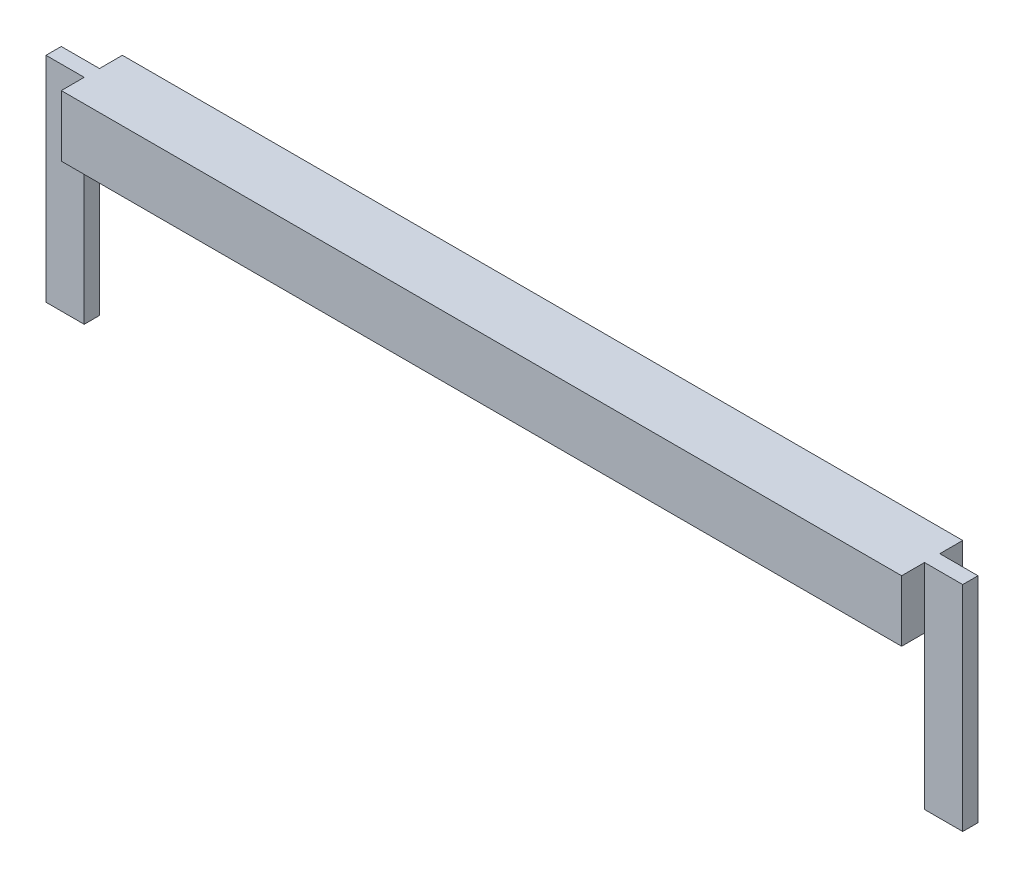
ISO-10303-21;
HEADER;
FILE_DESCRIPTION(('STEP AP214'),'2;1');
FILE_NAME('part.step','',(''),(''),'','','');
FILE_SCHEMA(('AUTOMOTIVE_DESIGN { 1 0 10303 214 1 1 1 1 }'));
ENDSEC;
DATA;
#1=APPLICATION_CONTEXT('core data for automotive mechanical design processes');
#2=APPLICATION_PROTOCOL_DEFINITION('international standard','automotive_design',2000,#1);
#3=PRODUCT_CONTEXT('',#1,'mechanical');
#4=PRODUCT('Part','Part','',(#3));
#5=PRODUCT_RELATED_PRODUCT_CATEGORY('part','',(#4));
#6=PRODUCT_DEFINITION_FORMATION('','',#4);
#7=PRODUCT_DEFINITION_CONTEXT('part definition',#1,'design');
#8=PRODUCT_DEFINITION('design','',#6,#7);
#9=PRODUCT_DEFINITION_SHAPE('','',#8);
#10=(LENGTH_UNIT() NAMED_UNIT(*) SI_UNIT(.MILLI.,.METRE.));
#11=(NAMED_UNIT(*) PLANE_ANGLE_UNIT() SI_UNIT($,.RADIAN.));
#12=(NAMED_UNIT(*) SI_UNIT($,.STERADIAN.) SOLID_ANGLE_UNIT());
#13=UNCERTAINTY_MEASURE_WITH_UNIT(LENGTH_MEASURE(1.E-05),#10,'distance_accuracy_value','');
#14=(GEOMETRIC_REPRESENTATION_CONTEXT(3) GLOBAL_UNCERTAINTY_ASSIGNED_CONTEXT((#13)) GLOBAL_UNIT_ASSIGNED_CONTEXT((#10,
#11,#12)) REPRESENTATION_CONTEXT('',''));
#15=CARTESIAN_POINT('',(0.,0.,0.));
#16=DIRECTION('',(0.,0.,1.));
#17=DIRECTION('',(1.,0.,0.));
#18=AXIS2_PLACEMENT_3D('',#15,#16,#17);
#19=CARTESIAN_POINT('',(0.,0.,0.5));
#20=DIRECTION('',(0.,1.,0.));
#21=DIRECTION('',(0.,0.,1.));
#22=AXIS2_PLACEMENT_3D('',#19,#20,#21);
#23=PLANE('',#22);
#24=DIRECTION('',(0.,0.,-1.));
#25=VECTOR('',#24,1.);
#26=CARTESIAN_POINT('',(28.75,0.,0.));
#27=LINE('',#26,#25);
#28=CARTESIAN_POINT('',(28.75,0.,0.5));
#29=VERTEX_POINT('',#28);
#30=CARTESIAN_POINT('',(28.75,0.,0.));
#31=VERTEX_POINT('',#30);
#32=EDGE_CURVE('E55',#29,#31,#27,.T.);
#33=ORIENTED_EDGE('',*,*,#32,.F.);
#34=DIRECTION('',(0.,0.,1.));
#35=VECTOR('',#34,1.);
#36=CARTESIAN_POINT('',(28.75,0.,-0.75));
#37=LINE('',#36,#35);
#38=CARTESIAN_POINT('',(28.75,0.,1.25));
#39=VERTEX_POINT('',#38);
#40=EDGE_CURVE('E242',#29,#39,#37,.T.);
#41=ORIENTED_EDGE('',*,*,#40,.T.);
#42=DIRECTION('',(1.,0.,0.));
#43=VECTOR('',#42,1.);
#44=CARTESIAN_POINT('',(28.75,0.,1.25));
#45=LINE('',#44,#43);
#46=CARTESIAN_POINT('',(1.25,0.,1.25));
#47=VERTEX_POINT('',#46);
#48=EDGE_CURVE('E210',#47,#39,#45,.T.);
#49=ORIENTED_EDGE('',*,*,#48,.F.);
#50=DIRECTION('',(0.,0.,1.));
#51=VECTOR('',#50,1.);
#52=CARTESIAN_POINT('',(1.25,0.,-0.75));
#53=LINE('',#52,#51);
#54=CARTESIAN_POINT('',(1.25,0.,0.5));
#55=VERTEX_POINT('',#54);
#56=EDGE_CURVE('E248',#55,#47,#53,.T.);
#57=ORIENTED_EDGE('',*,*,#56,.F.);
#58=DIRECTION('',(0.,0.,1.));
#59=VECTOR('',#58,1.);
#60=CARTESIAN_POINT('',(1.25,0.,0.));
#61=LINE('',#60,#59);
#62=CARTESIAN_POINT('',(1.25,0.,0.));
#63=VERTEX_POINT('',#62);
#64=EDGE_CURVE('E62',#63,#55,#61,.T.);
#65=ORIENTED_EDGE('',*,*,#64,.F.);
#66=CARTESIAN_POINT('',(1.25,0.,-0.75));
#67=VERTEX_POINT('',#66);
#68=EDGE_CURVE('E243',#67,#63,#53,.T.);
#69=ORIENTED_EDGE('',*,*,#68,.F.);
#70=DIRECTION('',(1.,0.,0.));
#71=VECTOR('',#70,1.);
#72=CARTESIAN_POINT('',(28.75,0.,-0.75));
#73=LINE('',#72,#71);
#74=CARTESIAN_POINT('',(28.75,0.,-0.75));
#75=VERTEX_POINT('',#74);
#76=EDGE_CURVE('E226',#67,#75,#73,.T.);
#77=ORIENTED_EDGE('',*,*,#76,.T.);
#78=EDGE_CURVE('E259',#75,#31,#37,.T.);
#79=ORIENTED_EDGE('',*,*,#78,.T.);
#80=EDGE_LOOP('',(#33,#41,#49,#57,#65,#69,#77,#79));
#81=FACE_BOUND('',#80,.T.);
#82=ADVANCED_FACE('F39',(#81),#23,.F.);
#83=CARTESIAN_POINT('',(0.,0.,0.5));
#84=DIRECTION('',(0.,0.,-1.));
#85=DIRECTION('',(-1.,0.,0.));
#86=AXIS2_PLACEMENT_3D('',#83,#84,#85);
#87=PLANE('',#86);
#88=DIRECTION('',(0.,1.,0.));
#89=VECTOR('',#88,1.);
#90=CARTESIAN_POINT('',(0.,0.,0.5));
#91=LINE('',#90,#89);
#92=CARTESIAN_POINT('',(0.,-5.,0.5));
#93=VERTEX_POINT('',#92);
#94=CARTESIAN_POINT('',(0.,2.,0.5));
#95=VERTEX_POINT('',#94);
#96=EDGE_CURVE('E269',#93,#95,#91,.T.);
#97=ORIENTED_EDGE('',*,*,#96,.F.);
#98=DIRECTION('',(-1.,0.,0.));
#99=VECTOR('',#98,1.);
#100=CARTESIAN_POINT('',(0.,-5.,0.5));
#101=LINE('',#100,#99);
#102=CARTESIAN_POINT('',(1.25,-5.,0.5));
#103=VERTEX_POINT('',#102);
#104=EDGE_CURVE('E196',#103,#93,#101,.T.);
#105=ORIENTED_EDGE('',*,*,#104,.F.);
#106=DIRECTION('',(0.,1.,0.));
#107=VECTOR('',#106,1.);
#108=CARTESIAN_POINT('',(1.25,-5.,0.5));
#109=LINE('',#108,#107);
#110=EDGE_CURVE('E200',#103,#55,#109,.T.);
#111=ORIENTED_EDGE('',*,*,#110,.T.);
#112=DIRECTION('',(0.,1.,0.));
#113=VECTOR('',#112,1.);
#114=CARTESIAN_POINT('',(1.25,0.,0.5));
#115=LINE('',#114,#113);
#116=CARTESIAN_POINT('',(1.25,2.,0.5));
#117=VERTEX_POINT('',#116);
#118=EDGE_CURVE('E264',#55,#117,#115,.T.);
#119=ORIENTED_EDGE('',*,*,#118,.T.);
#120=DIRECTION('',(1.,0.,0.));
#121=VECTOR('',#120,1.);
#122=CARTESIAN_POINT('',(0.,2.,0.5));
#123=LINE('',#122,#121);
#124=EDGE_CURVE('E154',#95,#117,#123,.T.);
#125=ORIENTED_EDGE('',*,*,#124,.F.);
#126=EDGE_LOOP('',(#97,#105,#111,#119,#125));
#127=FACE_BOUND('',#126,.T.);
#128=ADVANCED_FACE('F329',(#127),#87,.F.);
#129=CARTESIAN_POINT('',(0.,0.,0.));
#130=DIRECTION('',(0.,0.,-1.));
#131=DIRECTION('',(-1.,0.,0.));
#132=AXIS2_PLACEMENT_3D('',#129,#130,#131);
#133=PLANE('',#132);
#134=DIRECTION('',(0.,1.,0.));
#135=VECTOR('',#134,1.);
#136=CARTESIAN_POINT('',(1.25,0.,0.));
#137=LINE('',#136,#135);
#138=CARTESIAN_POINT('',(1.25,2.,0.));
#139=VERTEX_POINT('',#138);
#140=EDGE_CURVE('E11',#63,#139,#137,.T.);
#141=ORIENTED_EDGE('',*,*,#140,.F.);
#142=DIRECTION('',(0.,1.,0.));
#143=VECTOR('',#142,1.);
#144=CARTESIAN_POINT('',(1.25,-5.,0.));
#145=LINE('',#144,#143);
#146=CARTESIAN_POINT('',(1.25,-5.,0.));
#147=VERTEX_POINT('',#146);
#148=EDGE_CURVE('E206',#147,#63,#145,.T.);
#149=ORIENTED_EDGE('',*,*,#148,.F.);
#150=DIRECTION('',(1.,0.,0.));
#151=VECTOR('',#150,1.);
#152=CARTESIAN_POINT('',(0.,-5.,0.));
#153=LINE('',#152,#151);
#154=CARTESIAN_POINT('',(0.,-5.,0.));
#155=VERTEX_POINT('',#154);
#156=EDGE_CURVE('E190',#155,#147,#153,.T.);
#157=ORIENTED_EDGE('',*,*,#156,.F.);
#158=DIRECTION('',(0.,1.,0.));
#159=VECTOR('',#158,1.);
#160=CARTESIAN_POINT('',(0.,0.,0.));
#161=LINE('',#160,#159);
#162=CARTESIAN_POINT('',(0.,2.,0.));
#163=VERTEX_POINT('',#162);
#164=EDGE_CURVE('E268',#155,#163,#161,.T.);
#165=ORIENTED_EDGE('',*,*,#164,.T.);
#166=DIRECTION('',(1.,0.,0.));
#167=VECTOR('',#166,1.);
#168=CARTESIAN_POINT('',(0.,2.,0.));
#169=LINE('',#168,#167);
#170=EDGE_CURVE('E282',#163,#139,#169,.T.);
#171=ORIENTED_EDGE('',*,*,#170,.T.);
#172=EDGE_LOOP('',(#141,#149,#157,#165,#171));
#173=FACE_BOUND('',#172,.T.);
#174=ADVANCED_FACE('F337',(#173),#133,.T.);
#175=CARTESIAN_POINT('',(0.,0.,0.5));
#176=DIRECTION('',(-1.,0.,0.));
#177=DIRECTION('',(0.,0.,1.));
#178=AXIS2_PLACEMENT_3D('',#175,#176,#177);
#179=PLANE('',#178);
#180=ORIENTED_EDGE('',*,*,#164,.F.);
#181=DIRECTION('',(0.,0.,-1.));
#182=VECTOR('',#181,1.);
#183=CARTESIAN_POINT('',(0.,-5.,0.));
#184=LINE('',#183,#182);
#185=EDGE_CURVE('E186',#93,#155,#184,.T.);
#186=ORIENTED_EDGE('',*,*,#185,.F.);
#187=ORIENTED_EDGE('',*,*,#96,.T.);
#188=DIRECTION('',(0.,0.,-1.));
#189=VECTOR('',#188,1.);
#190=CARTESIAN_POINT('',(0.,2.,0.5));
#191=LINE('',#190,#189);
#192=EDGE_CURVE('E153',#95,#163,#191,.T.);
#193=ORIENTED_EDGE('',*,*,#192,.T.);
#194=EDGE_LOOP('',(#180,#186,#187,#193));
#195=FACE_BOUND('',#194,.T.);
#196=ADVANCED_FACE('F41',(#195),#179,.T.);
#197=CARTESIAN_POINT('',(30.,0.,0.5));
#198=DIRECTION('',(-1.,0.,0.));
#199=DIRECTION('',(0.,0.,1.));
#200=AXIS2_PLACEMENT_3D('',#197,#198,#199);
#201=PLANE('',#200);
#202=DIRECTION('',(0.,1.,0.));
#203=VECTOR('',#202,1.);
#204=CARTESIAN_POINT('',(30.,0.,0.));
#205=LINE('',#204,#203);
#206=CARTESIAN_POINT('',(30.,-5.,0.));
#207=VERTEX_POINT('',#206);
#208=CARTESIAN_POINT('',(30.,2.,0.));
#209=VERTEX_POINT('',#208);
#210=EDGE_CURVE('E274',#207,#209,#205,.T.);
#211=ORIENTED_EDGE('',*,*,#210,.T.);
#212=DIRECTION('',(0.,0.,-1.));
#213=VECTOR('',#212,1.);
#214=CARTESIAN_POINT('',(30.,2.,0.5));
#215=LINE('',#214,#213);
#216=CARTESIAN_POINT('',(30.,2.,0.5));
#217=VERTEX_POINT('',#216);
#218=EDGE_CURVE('E149',#217,#209,#215,.T.);
#219=ORIENTED_EDGE('',*,*,#218,.F.);
#220=DIRECTION('',(0.,1.,0.));
#221=VECTOR('',#220,1.);
#222=CARTESIAN_POINT('',(30.,0.,0.5));
#223=LINE('',#222,#221);
#224=CARTESIAN_POINT('',(30.,-5.,0.5));
#225=VERTEX_POINT('',#224);
#226=EDGE_CURVE('E142',#225,#217,#223,.T.);
#227=ORIENTED_EDGE('',*,*,#226,.F.);
#228=DIRECTION('',(0.,0.,1.));
#229=VECTOR('',#228,1.);
#230=CARTESIAN_POINT('',(30.,-5.,0.));
#231=LINE('',#230,#229);
#232=EDGE_CURVE('E147',#207,#225,#231,.T.);
#233=ORIENTED_EDGE('',*,*,#232,.F.);
#234=EDGE_LOOP('',(#211,#219,#227,#233));
#235=FACE_BOUND('',#234,.T.);
#236=ADVANCED_FACE('F145',(#235),#201,.F.);
#237=CARTESIAN_POINT('',(0.,2.,0.5));
#238=DIRECTION('',(0.,1.,0.));
#239=DIRECTION('',(-1.,0.,0.));
#240=AXIS2_PLACEMENT_3D('',#237,#238,#239);
#241=PLANE('',#240);
#242=CARTESIAN_POINT('',(28.75,2.,0.));
#243=VERTEX_POINT('',#242);
#244=EDGE_CURVE('E281',#243,#209,#169,.T.);
#245=ORIENTED_EDGE('',*,*,#244,.F.);
#246=DIRECTION('',(0.,0.,1.));
#247=VECTOR('',#246,1.);
#248=CARTESIAN_POINT('',(28.75,2.,-0.75));
#249=LINE('',#248,#247);
#250=CARTESIAN_POINT('',(28.75,2.,-0.75));
#251=VERTEX_POINT('',#250);
#252=EDGE_CURVE('E254',#251,#243,#249,.T.);
#253=ORIENTED_EDGE('',*,*,#252,.F.);
#254=DIRECTION('',(-1.,0.,0.));
#255=VECTOR('',#254,1.);
#256=CARTESIAN_POINT('',(1.25,2.,-0.75));
#257=LINE('',#256,#255);
#258=CARTESIAN_POINT('',(1.25,2.,-0.75));
#259=VERTEX_POINT('',#258);
#260=EDGE_CURVE('E234',#251,#259,#257,.T.);
#261=ORIENTED_EDGE('',*,*,#260,.T.);
#262=DIRECTION('',(0.,0.,1.));
#263=VECTOR('',#262,1.);
#264=CARTESIAN_POINT('',(1.25,2.,-0.75));
#265=LINE('',#264,#263);
#266=EDGE_CURVE('E249',#259,#139,#265,.T.);
#267=ORIENTED_EDGE('',*,*,#266,.T.);
#268=ORIENTED_EDGE('',*,*,#170,.F.);
#269=ORIENTED_EDGE('',*,*,#192,.F.);
#270=ORIENTED_EDGE('',*,*,#124,.T.);
#271=CARTESIAN_POINT('',(1.25,2.,1.25));
#272=VERTEX_POINT('',#271);
#273=EDGE_CURVE('E253',#117,#272,#265,.T.);
#274=ORIENTED_EDGE('',*,*,#273,.T.);
#275=DIRECTION('',(-1.,0.,0.));
#276=VECTOR('',#275,1.);
#277=CARTESIAN_POINT('',(1.25,2.,1.25));
#278=LINE('',#277,#276);
#279=CARTESIAN_POINT('',(28.75,2.,1.25));
#280=VERTEX_POINT('',#279);
#281=EDGE_CURVE('E218',#280,#272,#278,.T.);
#282=ORIENTED_EDGE('',*,*,#281,.F.);
#283=CARTESIAN_POINT('',(28.75,2.,0.5));
#284=VERTEX_POINT('',#283);
#285=EDGE_CURVE('E258',#284,#280,#249,.T.);
#286=ORIENTED_EDGE('',*,*,#285,.F.);
#287=EDGE_CURVE('E273',#284,#217,#123,.T.);
#288=ORIENTED_EDGE('',*,*,#287,.T.);
#289=ORIENTED_EDGE('',*,*,#218,.T.);
#290=EDGE_LOOP('',(#245,#253,#261,#267,#268,#269,#270,#274,#282,#286,#288,#289));
#291=FACE_BOUND('',#290,.T.);
#292=ADVANCED_FACE('F303',(#291),#241,.T.);
#293=ORIENTED_EDGE('',*,*,#287,.F.);
#294=DIRECTION('',(0.,-1.,0.));
#295=VECTOR('',#294,1.);
#296=CARTESIAN_POINT('',(28.75,0.,0.5));
#297=LINE('',#296,#295);
#298=EDGE_CURVE('E247',#284,#29,#297,.T.);
#299=ORIENTED_EDGE('',*,*,#298,.T.);
#300=DIRECTION('',(0.,1.,0.));
#301=VECTOR('',#300,1.);
#302=CARTESIAN_POINT('',(28.75,-5.,0.5));
#303=LINE('',#302,#301);
#304=CARTESIAN_POINT('',(28.75,-5.,0.5));
#305=VERTEX_POINT('',#304);
#306=EDGE_CURVE('E161',#305,#29,#303,.T.);
#307=ORIENTED_EDGE('',*,*,#306,.F.);
#308=DIRECTION('',(-1.,0.,0.));
#309=VECTOR('',#308,1.);
#310=CARTESIAN_POINT('',(30.,-5.,0.5));
#311=LINE('',#310,#309);
#312=EDGE_CURVE('E157',#225,#305,#311,.T.);
#313=ORIENTED_EDGE('',*,*,#312,.F.);
#314=ORIENTED_EDGE('',*,*,#226,.T.);
#315=EDGE_LOOP('',(#293,#299,#307,#313,#314));
#316=FACE_BOUND('',#315,.T.);
#317=ADVANCED_FACE('F158',(#316),#87,.F.);
#318=DIRECTION('',(0.,-1.,0.));
#319=VECTOR('',#318,1.);
#320=CARTESIAN_POINT('',(28.75,0.,0.));
#321=LINE('',#320,#319);
#322=EDGE_CURVE('E48',#243,#31,#321,.T.);
#323=ORIENTED_EDGE('',*,*,#322,.F.);
#324=ORIENTED_EDGE('',*,*,#244,.T.);
#325=ORIENTED_EDGE('',*,*,#210,.F.);
#326=DIRECTION('',(1.,0.,0.));
#327=VECTOR('',#326,1.);
#328=CARTESIAN_POINT('',(30.,-5.,0.));
#329=LINE('',#328,#327);
#330=CARTESIAN_POINT('',(28.75,-5.,0.));
#331=VERTEX_POINT('',#330);
#332=EDGE_CURVE('E170',#331,#207,#329,.T.);
#333=ORIENTED_EDGE('',*,*,#332,.F.);
#334=DIRECTION('',(0.,1.,0.));
#335=VECTOR('',#334,1.);
#336=CARTESIAN_POINT('',(28.75,-5.,0.));
#337=LINE('',#336,#335);
#338=EDGE_CURVE('E179',#331,#31,#337,.T.);
#339=ORIENTED_EDGE('',*,*,#338,.T.);
#340=EDGE_LOOP('',(#323,#324,#325,#333,#339));
#341=FACE_BOUND('',#340,.T.);
#342=ADVANCED_FACE('F300',(#341),#133,.T.);
#343=CARTESIAN_POINT('',(0.,0.,-0.75));
#344=DIRECTION('',(0.,0.,-1.));
#345=DIRECTION('',(-1.,0.,0.));
#346=AXIS2_PLACEMENT_3D('',#343,#344,#345);
#347=PLANE('',#346);
#348=ORIENTED_EDGE('',*,*,#76,.F.);
#349=DIRECTION('',(0.,-1.,0.));
#350=VECTOR('',#349,1.);
#351=CARTESIAN_POINT('',(1.25,0.,-0.75));
#352=LINE('',#351,#350);
#353=EDGE_CURVE('E238',#259,#67,#352,.T.);
#354=ORIENTED_EDGE('',*,*,#353,.F.);
#355=ORIENTED_EDGE('',*,*,#260,.F.);
#356=DIRECTION('',(0.,1.,0.));
#357=VECTOR('',#356,1.);
#358=CARTESIAN_POINT('',(28.75,2.,-0.75));
#359=LINE('',#358,#357);
#360=EDGE_CURVE('E230',#75,#251,#359,.T.);
#361=ORIENTED_EDGE('',*,*,#360,.F.);
#362=EDGE_LOOP('',(#348,#354,#355,#361));
#363=FACE_BOUND('',#362,.T.);
#364=ADVANCED_FACE('F342',(#363),#347,.T.);
#365=CARTESIAN_POINT('',(28.75,2.,-0.75));
#366=DIRECTION('',(1.,0.,0.));
#367=DIRECTION('',(0.,0.,-1.));
#368=AXIS2_PLACEMENT_3D('',#365,#366,#367);
#369=PLANE('',#368);
#370=ORIENTED_EDGE('',*,*,#252,.T.);
#371=ORIENTED_EDGE('',*,*,#322,.T.);
#372=ORIENTED_EDGE('',*,*,#78,.F.);
#373=ORIENTED_EDGE('',*,*,#360,.T.);
#374=EDGE_LOOP('',(#370,#371,#372,#373));
#375=FACE_BOUND('',#374,.T.);
#376=ADVANCED_FACE('F292',(#375),#369,.T.);
#377=CARTESIAN_POINT('',(1.25,0.,-0.75));
#378=DIRECTION('',(-1.,0.,0.));
#379=DIRECTION('',(0.,0.,1.));
#380=AXIS2_PLACEMENT_3D('',#377,#378,#379);
#381=PLANE('',#380);
#382=ORIENTED_EDGE('',*,*,#68,.T.);
#383=ORIENTED_EDGE('',*,*,#140,.T.);
#384=ORIENTED_EDGE('',*,*,#266,.F.);
#385=ORIENTED_EDGE('',*,*,#353,.T.);
#386=EDGE_LOOP('',(#382,#383,#384,#385));
#387=FACE_BOUND('',#386,.T.);
#388=ADVANCED_FACE('F339',(#387),#381,.T.);
#389=ORIENTED_EDGE('',*,*,#118,.F.);
#390=ORIENTED_EDGE('',*,*,#56,.T.);
#391=DIRECTION('',(0.,-1.,0.));
#392=VECTOR('',#391,1.);
#393=CARTESIAN_POINT('',(1.25,0.,1.25));
#394=LINE('',#393,#392);
#395=EDGE_CURVE('E222',#272,#47,#394,.T.);
#396=ORIENTED_EDGE('',*,*,#395,.F.);
#397=ORIENTED_EDGE('',*,*,#273,.F.);
#398=EDGE_LOOP('',(#389,#390,#396,#397));
#399=FACE_BOUND('',#398,.T.);
#400=ADVANCED_FACE('F320',(#399),#381,.T.);
#401=ORIENTED_EDGE('',*,*,#298,.F.);
#402=ORIENTED_EDGE('',*,*,#285,.T.);
#403=DIRECTION('',(0.,1.,0.));
#404=VECTOR('',#403,1.);
#405=CARTESIAN_POINT('',(28.75,2.,1.25));
#406=LINE('',#405,#404);
#407=EDGE_CURVE('E214',#39,#280,#406,.T.);
#408=ORIENTED_EDGE('',*,*,#407,.F.);
#409=ORIENTED_EDGE('',*,*,#40,.F.);
#410=EDGE_LOOP('',(#401,#402,#408,#409));
#411=FACE_BOUND('',#410,.T.);
#412=ADVANCED_FACE('F314',(#411),#369,.T.);
#413=CARTESIAN_POINT('',(0.,0.,1.25));
#414=DIRECTION('',(0.,0.,-1.));
#415=DIRECTION('',(-1.,0.,0.));
#416=AXIS2_PLACEMENT_3D('',#413,#414,#415);
#417=PLANE('',#416);
#418=ORIENTED_EDGE('',*,*,#48,.T.);
#419=ORIENTED_EDGE('',*,*,#407,.T.);
#420=ORIENTED_EDGE('',*,*,#281,.T.);
#421=ORIENTED_EDGE('',*,*,#395,.T.);
#422=EDGE_LOOP('',(#418,#419,#420,#421));
#423=FACE_BOUND('',#422,.T.);
#424=ADVANCED_FACE('F316',(#423),#417,.F.);
#425=CARTESIAN_POINT('',(1.25,-5.,0.));
#426=DIRECTION('',(-1.,0.,0.));
#427=DIRECTION('',(0.,0.,1.));
#428=AXIS2_PLACEMENT_3D('',#425,#426,#427);
#429=PLANE('',#428);
#430=ORIENTED_EDGE('',*,*,#64,.T.);
#431=ORIENTED_EDGE('',*,*,#110,.F.);
#432=DIRECTION('',(0.,0.,1.));
#433=VECTOR('',#432,1.);
#434=CARTESIAN_POINT('',(1.25,-5.,0.));
#435=LINE('',#434,#433);
#436=EDGE_CURVE('E193',#147,#103,#435,.T.);
#437=ORIENTED_EDGE('',*,*,#436,.F.);
#438=ORIENTED_EDGE('',*,*,#148,.T.);
#439=EDGE_LOOP('',(#430,#431,#437,#438));
#440=FACE_BOUND('',#439,.T.);
#441=ADVANCED_FACE('F325',(#440),#429,.F.);
#442=CARTESIAN_POINT('',(0.,-5.,0.));
#443=DIRECTION('',(0.,1.,0.));
#444=DIRECTION('',(0.,0.,1.));
#445=AXIS2_PLACEMENT_3D('',#442,#443,#444);
#446=PLANE('',#445);
#447=ORIENTED_EDGE('',*,*,#185,.T.);
#448=ORIENTED_EDGE('',*,*,#156,.T.);
#449=ORIENTED_EDGE('',*,*,#436,.T.);
#450=ORIENTED_EDGE('',*,*,#104,.T.);
#451=EDGE_LOOP('',(#447,#448,#449,#450));
#452=FACE_BOUND('',#451,.T.);
#453=ADVANCED_FACE('F332',(#452),#446,.F.);
#454=CARTESIAN_POINT('',(28.75,-5.,0.));
#455=DIRECTION('',(1.,0.,0.));
#456=DIRECTION('',(0.,0.,-1.));
#457=AXIS2_PLACEMENT_3D('',#454,#455,#456);
#458=PLANE('',#457);
#459=ORIENTED_EDGE('',*,*,#32,.T.);
#460=ORIENTED_EDGE('',*,*,#338,.F.);
#461=DIRECTION('',(0.,0.,-1.));
#462=VECTOR('',#461,1.);
#463=CARTESIAN_POINT('',(28.75,-5.,0.));
#464=LINE('',#463,#462);
#465=EDGE_CURVE('E165',#305,#331,#464,.T.);
#466=ORIENTED_EDGE('',*,*,#465,.F.);
#467=ORIENTED_EDGE('',*,*,#306,.T.);
#468=EDGE_LOOP('',(#459,#460,#466,#467));
#469=FACE_BOUND('',#468,.T.);
#470=ADVANCED_FACE('F299',(#469),#458,.F.);
#471=CARTESIAN_POINT('',(0.,-5.,0.));
#472=DIRECTION('',(0.,-1.,0.));
#473=DIRECTION('',(0.,0.,-1.));
#474=AXIS2_PLACEMENT_3D('',#471,#472,#473);
#475=PLANE('',#474);
#476=ORIENTED_EDGE('',*,*,#232,.T.);
#477=ORIENTED_EDGE('',*,*,#312,.T.);
#478=ORIENTED_EDGE('',*,*,#465,.T.);
#479=ORIENTED_EDGE('',*,*,#332,.T.);
#480=EDGE_LOOP('',(#476,#477,#478,#479));
#481=FACE_BOUND('',#480,.T.);
#482=ADVANCED_FACE('F168',(#481),#475,.T.);
#483=CLOSED_SHELL('',(#82,#128,#174,#196,#236,#292,#317,#342,#364,#376,#388,#400,#412,#424,#441,
#453,#470,#482));
#484=MANIFOLD_SOLID_BREP('B2',#483);
#485=ADVANCED_BREP_SHAPE_REPRESENTATION('',(#18,#484),#14);
#486=SHAPE_DEFINITION_REPRESENTATION(#9,#485);
ENDSEC;
END-ISO-10303-21;
